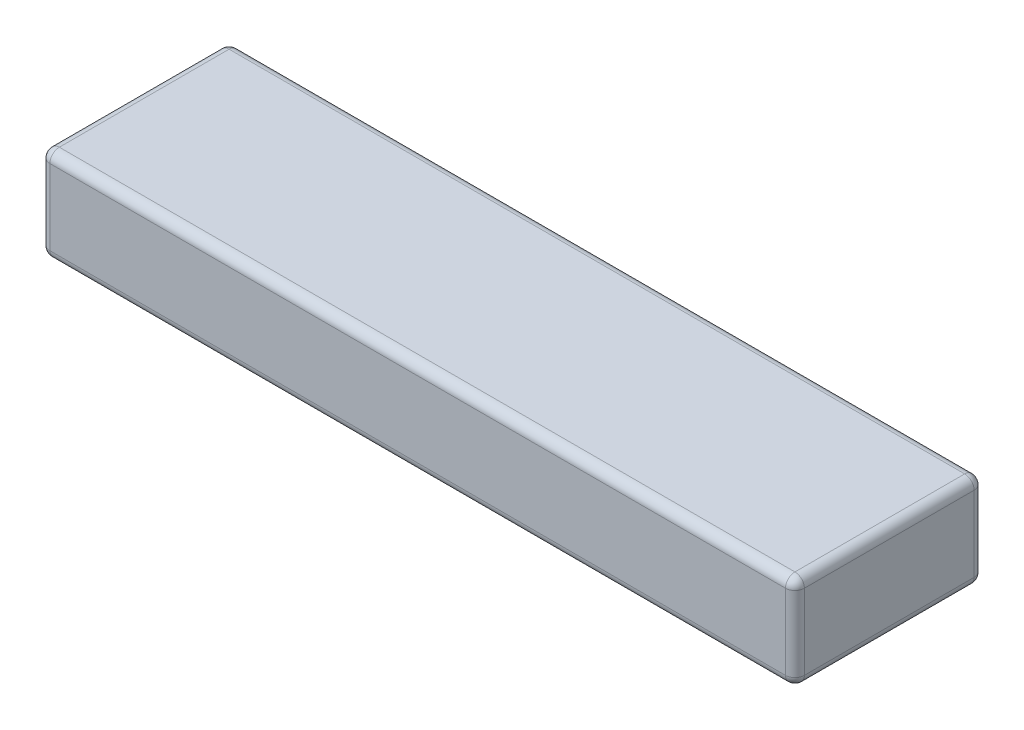
ISO-10303-21;
HEADER;
FILE_DESCRIPTION(('STEP AP214'),'2;1');
FILE_NAME('part.step','',(''),(''),'','','');
FILE_SCHEMA(('AUTOMOTIVE_DESIGN { 1 0 10303 214 1 1 1 1 }'));
ENDSEC;
DATA;
#1=APPLICATION_CONTEXT('core data for automotive mechanical design processes');
#2=APPLICATION_PROTOCOL_DEFINITION('international standard','automotive_design',2000,#1);
#3=PRODUCT_CONTEXT('',#1,'mechanical');
#4=PRODUCT('Part','Part','',(#3));
#5=PRODUCT_RELATED_PRODUCT_CATEGORY('part','',(#4));
#6=PRODUCT_DEFINITION_FORMATION('','',#4);
#7=PRODUCT_DEFINITION_CONTEXT('part definition',#1,'design');
#8=PRODUCT_DEFINITION('design','',#6,#7);
#9=PRODUCT_DEFINITION_SHAPE('','',#8);
#10=(LENGTH_UNIT() NAMED_UNIT(*) SI_UNIT(.MILLI.,.METRE.));
#11=(NAMED_UNIT(*) PLANE_ANGLE_UNIT() SI_UNIT($,.RADIAN.));
#12=(NAMED_UNIT(*) SI_UNIT($,.STERADIAN.) SOLID_ANGLE_UNIT());
#13=UNCERTAINTY_MEASURE_WITH_UNIT(LENGTH_MEASURE(1.E-05),#10,'distance_accuracy_value','');
#14=(GEOMETRIC_REPRESENTATION_CONTEXT(3) GLOBAL_UNCERTAINTY_ASSIGNED_CONTEXT((#13)) GLOBAL_UNIT_ASSIGNED_CONTEXT((#10,
#11,#12)) REPRESENTATION_CONTEXT('',''));
#15=CARTESIAN_POINT('',(0.,0.,0.));
#16=DIRECTION('',(0.,0.,1.));
#17=DIRECTION('',(1.,0.,0.));
#18=AXIS2_PLACEMENT_3D('',#15,#16,#17);
#19=CARTESIAN_POINT('',(20.,5.,5.));
#20=DIRECTION('',(-1.,0.,0.));
#21=DIRECTION('',(0.,0.,1.));
#22=AXIS2_PLACEMENT_3D('',#19,#20,#21);
#23=PLANE('',#22);
#24=DIRECTION('',(0.,-1.,0.));
#25=VECTOR('',#24,1.);
#26=CARTESIAN_POINT('',(20.,5.,-4.5));
#27=LINE('',#26,#25);
#28=CARTESIAN_POINT('',(20.,0.5,-4.5));
#29=VERTEX_POINT('',#28);
#30=CARTESIAN_POINT('',(20.,4.5,-4.5));
#31=VERTEX_POINT('',#30);
#32=EDGE_CURVE('E190',#29,#31,#27,.F.);
#33=ORIENTED_EDGE('',*,*,#32,.T.);
#34=DIRECTION('',(0.,0.,-1.));
#35=VECTOR('',#34,1.);
#36=CARTESIAN_POINT('',(20.,4.5,5.));
#37=LINE('',#36,#35);
#38=CARTESIAN_POINT('',(20.,4.5,4.5));
#39=VERTEX_POINT('',#38);
#40=EDGE_CURVE('E192',#31,#39,#37,.F.);
#41=ORIENTED_EDGE('',*,*,#40,.T.);
#42=DIRECTION('',(0.,-1.,0.));
#43=VECTOR('',#42,1.);
#44=CARTESIAN_POINT('',(20.,5.,4.5));
#45=LINE('',#44,#43);
#46=CARTESIAN_POINT('',(20.,0.5,4.5));
#47=VERTEX_POINT('',#46);
#48=EDGE_CURVE('E186',#39,#47,#45,.T.);
#49=ORIENTED_EDGE('',*,*,#48,.T.);
#50=DIRECTION('',(0.,0.,-1.));
#51=VECTOR('',#50,1.);
#52=CARTESIAN_POINT('',(20.,0.5,-5.));
#53=LINE('',#52,#51);
#54=EDGE_CURVE('E188',#47,#29,#53,.T.);
#55=ORIENTED_EDGE('',*,*,#54,.T.);
#56=EDGE_LOOP('',(#33,#41,#49,#55));
#57=FACE_BOUND('',#56,.T.);
#58=ADVANCED_FACE('F33',(#57),#23,.F.);
#59=CARTESIAN_POINT('',(-20.,5.,-5.));
#60=DIRECTION('',(0.,0.,1.));
#61=DIRECTION('',(1.,0.,0.));
#62=AXIS2_PLACEMENT_3D('',#59,#60,#61);
#63=PLANE('',#62);
#64=DIRECTION('',(-1.,0.,0.));
#65=VECTOR('',#64,1.);
#66=CARTESIAN_POINT('',(-20.,0.5,-5.));
#67=LINE('',#66,#65);
#68=CARTESIAN_POINT('',(19.5,0.5,-5.));
#69=VERTEX_POINT('',#68);
#70=CARTESIAN_POINT('',(-19.5,0.5,-5.));
#71=VERTEX_POINT('',#70);
#72=EDGE_CURVE('E172',#69,#71,#67,.T.);
#73=ORIENTED_EDGE('',*,*,#72,.T.);
#74=DIRECTION('',(0.,-1.,0.));
#75=VECTOR('',#74,1.);
#76=CARTESIAN_POINT('',(-19.5,5.,-5.));
#77=LINE('',#76,#75);
#78=CARTESIAN_POINT('',(-19.5,4.5,-5.));
#79=VERTEX_POINT('',#78);
#80=EDGE_CURVE('E174',#71,#79,#77,.F.);
#81=ORIENTED_EDGE('',*,*,#80,.T.);
#82=DIRECTION('',(-1.,0.,0.));
#83=VECTOR('',#82,1.);
#84=CARTESIAN_POINT('',(-20.,4.5,-5.));
#85=LINE('',#84,#83);
#86=CARTESIAN_POINT('',(19.5,4.5,-5.));
#87=VERTEX_POINT('',#86);
#88=EDGE_CURVE('E170',#79,#87,#85,.F.);
#89=ORIENTED_EDGE('',*,*,#88,.T.);
#90=DIRECTION('',(0.,-1.,0.));
#91=VECTOR('',#90,1.);
#92=CARTESIAN_POINT('',(19.5,5.,-5.));
#93=LINE('',#92,#91);
#94=EDGE_CURVE('E168',#87,#69,#93,.T.);
#95=ORIENTED_EDGE('',*,*,#94,.T.);
#96=EDGE_LOOP('',(#73,#81,#89,#95));
#97=FACE_BOUND('',#96,.T.);
#98=ADVANCED_FACE('F272',(#97),#63,.F.);
#99=CARTESIAN_POINT('',(-20.,5.,5.));
#100=DIRECTION('',(1.,0.,0.));
#101=DIRECTION('',(0.,0.,-1.));
#102=AXIS2_PLACEMENT_3D('',#99,#100,#101);
#103=PLANE('',#102);
#104=DIRECTION('',(0.,-1.,0.));
#105=VECTOR('',#104,1.);
#106=CARTESIAN_POINT('',(-20.,5.,-4.5));
#107=LINE('',#106,#105);
#108=CARTESIAN_POINT('',(-20.,4.5,-4.5));
#109=VERTEX_POINT('',#108);
#110=CARTESIAN_POINT('',(-20.,0.5,-4.5));
#111=VERTEX_POINT('',#110);
#112=EDGE_CURVE('E155',#109,#111,#107,.T.);
#113=ORIENTED_EDGE('',*,*,#112,.T.);
#114=DIRECTION('',(0.,0.,1.));
#115=VECTOR('',#114,1.);
#116=CARTESIAN_POINT('',(-20.,0.5,5.));
#117=LINE('',#116,#115);
#118=CARTESIAN_POINT('',(-20.,0.5,4.5));
#119=VERTEX_POINT('',#118);
#120=EDGE_CURVE('E127',#111,#119,#117,.T.);
#121=ORIENTED_EDGE('',*,*,#120,.T.);
#122=DIRECTION('',(0.,-1.,0.));
#123=VECTOR('',#122,1.);
#124=CARTESIAN_POINT('',(-20.,5.,4.5));
#125=LINE('',#124,#123);
#126=CARTESIAN_POINT('',(-20.,4.5,4.5));
#127=VERTEX_POINT('',#126);
#128=EDGE_CURVE('E145',#119,#127,#125,.F.);
#129=ORIENTED_EDGE('',*,*,#128,.T.);
#130=DIRECTION('',(0.,0.,1.));
#131=VECTOR('',#130,1.);
#132=CARTESIAN_POINT('',(-20.,4.5,5.));
#133=LINE('',#132,#131);
#134=EDGE_CURVE('E151',#127,#109,#133,.F.);
#135=ORIENTED_EDGE('',*,*,#134,.T.);
#136=EDGE_LOOP('',(#113,#121,#129,#135));
#137=FACE_BOUND('',#136,.T.);
#138=ADVANCED_FACE('F153',(#137),#103,.F.);
#139=CARTESIAN_POINT('',(-20.,5.,5.));
#140=DIRECTION('',(0.,0.,-1.));
#141=DIRECTION('',(-1.,0.,0.));
#142=AXIS2_PLACEMENT_3D('',#139,#140,#141);
#143=PLANE('',#142);
#144=DIRECTION('',(1.,0.,0.));
#145=VECTOR('',#144,1.);
#146=CARTESIAN_POINT('',(-20.,4.5,5.));
#147=LINE('',#146,#145);
#148=CARTESIAN_POINT('',(19.5,4.5,5.));
#149=VERTEX_POINT('',#148);
#150=CARTESIAN_POINT('',(-19.5,4.5,5.));
#151=VERTEX_POINT('',#150);
#152=EDGE_CURVE('E42',#149,#151,#147,.F.);
#153=ORIENTED_EDGE('',*,*,#152,.T.);
#154=DIRECTION('',(0.,-1.,0.));
#155=VECTOR('',#154,1.);
#156=CARTESIAN_POINT('',(-19.5,5.,5.));
#157=LINE('',#156,#155);
#158=CARTESIAN_POINT('',(-19.5,0.5,5.));
#159=VERTEX_POINT('',#158);
#160=EDGE_CURVE('E11',#151,#159,#157,.T.);
#161=ORIENTED_EDGE('',*,*,#160,.T.);
#162=DIRECTION('',(1.,0.,0.));
#163=VECTOR('',#162,1.);
#164=CARTESIAN_POINT('',(20.,0.5,5.));
#165=LINE('',#164,#163);
#166=CARTESIAN_POINT('',(19.5,0.5,5.));
#167=VERTEX_POINT('',#166);
#168=EDGE_CURVE('E195',#159,#167,#165,.T.);
#169=ORIENTED_EDGE('',*,*,#168,.T.);
#170=DIRECTION('',(0.,-1.,0.));
#171=VECTOR('',#170,1.);
#172=CARTESIAN_POINT('',(19.5,5.,5.));
#173=LINE('',#172,#171);
#174=EDGE_CURVE('E53',#167,#149,#173,.F.);
#175=ORIENTED_EDGE('',*,*,#174,.T.);
#176=EDGE_LOOP('',(#153,#161,#169,#175));
#177=FACE_BOUND('',#176,.T.);
#178=ADVANCED_FACE('F491',(#177),#143,.F.);
#179=CARTESIAN_POINT('',(0.,5.,0.));
#180=DIRECTION('',(0.,-1.,0.));
#181=DIRECTION('',(0.,0.,-1.));
#182=AXIS2_PLACEMENT_3D('',#179,#180,#181);
#183=PLANE('',#182);
#184=DIRECTION('',(-1.,0.,0.));
#185=VECTOR('',#184,1.);
#186=CARTESIAN_POINT('',(0.,5.,-4.5));
#187=LINE('',#186,#185);
#188=CARTESIAN_POINT('',(19.5,5.,-4.5));
#189=VERTEX_POINT('',#188);
#190=CARTESIAN_POINT('',(-19.5,5.,-4.5));
#191=VERTEX_POINT('',#190);
#192=EDGE_CURVE('E181',#189,#191,#187,.T.);
#193=ORIENTED_EDGE('',*,*,#192,.T.);
#194=DIRECTION('',(0.,0.,1.));
#195=VECTOR('',#194,1.);
#196=CARTESIAN_POINT('',(-19.5,5.,0.));
#197=LINE('',#196,#195);
#198=CARTESIAN_POINT('',(-19.5,5.,4.5));
#199=VERTEX_POINT('',#198);
#200=EDGE_CURVE('E183',#191,#199,#197,.T.);
#201=ORIENTED_EDGE('',*,*,#200,.T.);
#202=DIRECTION('',(1.,0.,0.));
#203=VECTOR('',#202,1.);
#204=CARTESIAN_POINT('',(0.,5.,4.5));
#205=LINE('',#204,#203);
#206=CARTESIAN_POINT('',(19.5,5.,4.5));
#207=VERTEX_POINT('',#206);
#208=EDGE_CURVE('E177',#199,#207,#205,.T.);
#209=ORIENTED_EDGE('',*,*,#208,.T.);
#210=DIRECTION('',(0.,0.,-1.));
#211=VECTOR('',#210,1.);
#212=CARTESIAN_POINT('',(19.5,5.,0.));
#213=LINE('',#212,#211);
#214=EDGE_CURVE('E179',#207,#189,#213,.T.);
#215=ORIENTED_EDGE('',*,*,#214,.T.);
#216=EDGE_LOOP('',(#193,#201,#209,#215));
#217=FACE_BOUND('',#216,.T.);
#218=ADVANCED_FACE('F281',(#217),#183,.F.);
#219=CARTESIAN_POINT('',(0.,0.,0.));
#220=DIRECTION('',(0.,-1.,0.));
#221=DIRECTION('',(0.,0.,-1.));
#222=AXIS2_PLACEMENT_3D('',#219,#220,#221);
#223=PLANE('',#222);
#224=DIRECTION('',(1.,0.,0.));
#225=VECTOR('',#224,1.);
#226=CARTESIAN_POINT('',(-20.,0.,4.5));
#227=LINE('',#226,#225);
#228=CARTESIAN_POINT('',(19.5,0.,4.5));
#229=VERTEX_POINT('',#228);
#230=CARTESIAN_POINT('',(-19.5,0.,4.5));
#231=VERTEX_POINT('',#230);
#232=EDGE_CURVE('E157',#229,#231,#227,.F.);
#233=ORIENTED_EDGE('',*,*,#232,.T.);
#234=DIRECTION('',(0.,0.,1.));
#235=VECTOR('',#234,1.);
#236=CARTESIAN_POINT('',(-19.5,0.,-5.));
#237=LINE('',#236,#235);
#238=CARTESIAN_POINT('',(-19.5,0.,-4.5));
#239=VERTEX_POINT('',#238);
#240=EDGE_CURVE('E129',#231,#239,#237,.F.);
#241=ORIENTED_EDGE('',*,*,#240,.T.);
#242=DIRECTION('',(-1.,0.,0.));
#243=VECTOR('',#242,1.);
#244=CARTESIAN_POINT('',(20.,0.,-4.5));
#245=LINE('',#244,#243);
#246=CARTESIAN_POINT('',(19.5,0.,-4.5));
#247=VERTEX_POINT('',#246);
#248=EDGE_CURVE('E165',#239,#247,#245,.F.);
#249=ORIENTED_EDGE('',*,*,#248,.T.);
#250=DIRECTION('',(0.,0.,-1.));
#251=VECTOR('',#250,1.);
#252=CARTESIAN_POINT('',(19.5,0.,5.));
#253=LINE('',#252,#251);
#254=EDGE_CURVE('E159',#247,#229,#253,.F.);
#255=ORIENTED_EDGE('',*,*,#254,.T.);
#256=EDGE_LOOP('',(#233,#241,#249,#255));
#257=FACE_BOUND('',#256,.T.);
#258=ADVANCED_FACE('F307',(#257),#223,.T.);
#259=CARTESIAN_POINT('',(19.5,4.5,0.));
#260=DIRECTION('',(0.,0.,-1.));
#261=DIRECTION('',(-1.,0.,0.));
#262=AXIS2_PLACEMENT_3D('',#259,#260,#261);
#263=CYLINDRICAL_SURFACE('',#262,0.5);
#264=CARTESIAN_POINT('',(19.5,4.5,-4.5));
#265=DIRECTION('',(0.,0.,-1.));
#266=DIRECTION('',(-1.,0.,0.));
#267=AXIS2_PLACEMENT_3D('',#264,#265,#266);
#268=CIRCLE('',#267,0.5);
#269=EDGE_CURVE('E37',#189,#31,#268,.T.);
#270=ORIENTED_EDGE('',*,*,#269,.F.);
#271=ORIENTED_EDGE('',*,*,#214,.F.);
#272=CARTESIAN_POINT('',(19.5,4.5,4.5));
#273=DIRECTION('',(0.,0.,1.));
#274=DIRECTION('',(1.,0.,0.));
#275=AXIS2_PLACEMENT_3D('',#272,#273,#274);
#276=CIRCLE('',#275,0.5);
#277=EDGE_CURVE('E248',#39,#207,#276,.T.);
#278=ORIENTED_EDGE('',*,*,#277,.F.);
#279=ORIENTED_EDGE('',*,*,#40,.F.);
#280=EDGE_LOOP('',(#270,#271,#278,#279));
#281=FACE_BOUND('',#280,.T.);
#282=ADVANCED_FACE('F35',(#281),#263,.T.);
#283=CARTESIAN_POINT('',(19.5,4.5,-4.5));
#284=DIRECTION('',(0.,0.,1.));
#285=DIRECTION('',(1.,0.,0.));
#286=AXIS2_PLACEMENT_3D('',#283,#284,#285);
#287=SPHERICAL_SURFACE('',#286,0.5);
#288=CARTESIAN_POINT('',(19.5,4.5,-4.5));
#289=DIRECTION('',(1.,0.,0.));
#290=DIRECTION('',(0.,1.,0.));
#291=AXIS2_PLACEMENT_3D('',#288,#289,#290);
#292=CIRCLE('',#291,0.5);
#293=EDGE_CURVE('E243',#189,#87,#292,.F.);
#294=ORIENTED_EDGE('',*,*,#293,.F.);
#295=ORIENTED_EDGE('',*,*,#269,.T.);
#296=CARTESIAN_POINT('',(19.5,4.5,-4.5));
#297=DIRECTION('',(0.,1.,0.));
#298=DIRECTION('',(0.,0.,1.));
#299=AXIS2_PLACEMENT_3D('',#296,#297,#298);
#300=CIRCLE('',#299,0.5);
#301=EDGE_CURVE('E246',#87,#31,#300,.F.);
#302=ORIENTED_EDGE('',*,*,#301,.F.);
#303=EDGE_LOOP('',(#294,#295,#302));
#304=FACE_BOUND('',#303,.T.);
#305=ADVANCED_FACE('F259',(#304),#287,.T.);
#306=CARTESIAN_POINT('',(19.5,4.5,4.5));
#307=DIRECTION('',(0.,0.,1.));
#308=DIRECTION('',(1.,0.,0.));
#309=AXIS2_PLACEMENT_3D('',#306,#307,#308);
#310=SPHERICAL_SURFACE('',#309,0.5);
#311=CARTESIAN_POINT('',(19.5,4.5,4.5));
#312=DIRECTION('',(0.,1.,0.));
#313=DIRECTION('',(0.,0.,1.));
#314=AXIS2_PLACEMENT_3D('',#311,#312,#313);
#315=CIRCLE('',#314,0.5);
#316=EDGE_CURVE('E238',#39,#149,#315,.F.);
#317=ORIENTED_EDGE('',*,*,#316,.F.);
#318=ORIENTED_EDGE('',*,*,#277,.T.);
#319=CARTESIAN_POINT('',(19.5,4.5,4.5));
#320=DIRECTION('',(1.,0.,0.));
#321=DIRECTION('',(0.,0.,-1.));
#322=AXIS2_PLACEMENT_3D('',#319,#320,#321);
#323=CIRCLE('',#322,0.5);
#324=EDGE_CURVE('E240',#149,#207,#323,.F.);
#325=ORIENTED_EDGE('',*,*,#324,.F.);
#326=EDGE_LOOP('',(#317,#318,#325));
#327=FACE_BOUND('',#326,.T.);
#328=ADVANCED_FACE('F457',(#327),#310,.T.);
#329=CARTESIAN_POINT('',(19.5,5.,-4.5));
#330=DIRECTION('',(0.,-1.,0.));
#331=DIRECTION('',(0.,0.,-1.));
#332=AXIS2_PLACEMENT_3D('',#329,#330,#331);
#333=CYLINDRICAL_SURFACE('',#332,0.5);
#334=ORIENTED_EDGE('',*,*,#301,.T.);
#335=ORIENTED_EDGE('',*,*,#32,.F.);
#336=CARTESIAN_POINT('',(19.5,0.5,-4.5));
#337=DIRECTION('',(0.,-1.,0.));
#338=DIRECTION('',(0.,0.,-1.));
#339=AXIS2_PLACEMENT_3D('',#336,#337,#338);
#340=CIRCLE('',#339,0.5);
#341=EDGE_CURVE('E232',#69,#29,#340,.T.);
#342=ORIENTED_EDGE('',*,*,#341,.F.);
#343=ORIENTED_EDGE('',*,*,#94,.F.);
#344=EDGE_LOOP('',(#334,#335,#342,#343));
#345=FACE_BOUND('',#344,.T.);
#346=ADVANCED_FACE('F267',(#345),#333,.T.);
#347=CARTESIAN_POINT('',(0.,4.5,-4.5));
#348=DIRECTION('',(-1.,0.,0.));
#349=DIRECTION('',(0.,0.,1.));
#350=AXIS2_PLACEMENT_3D('',#347,#348,#349);
#351=CYLINDRICAL_SURFACE('',#350,0.5);
#352=ORIENTED_EDGE('',*,*,#293,.T.);
#353=ORIENTED_EDGE('',*,*,#88,.F.);
#354=CARTESIAN_POINT('',(-19.5,4.5,-4.5));
#355=DIRECTION('',(-1.,0.,0.));
#356=DIRECTION('',(0.,0.,1.));
#357=AXIS2_PLACEMENT_3D('',#354,#355,#356);
#358=CIRCLE('',#357,0.5);
#359=EDGE_CURVE('E229',#191,#79,#358,.T.);
#360=ORIENTED_EDGE('',*,*,#359,.F.);
#361=ORIENTED_EDGE('',*,*,#192,.F.);
#362=EDGE_LOOP('',(#352,#353,#360,#361));
#363=FACE_BOUND('',#362,.T.);
#364=ADVANCED_FACE('F278',(#363),#351,.T.);
#365=CARTESIAN_POINT('',(-19.5,4.5,0.));
#366=DIRECTION('',(0.,0.,1.));
#367=DIRECTION('',(1.,0.,0.));
#368=AXIS2_PLACEMENT_3D('',#365,#366,#367);
#369=CYLINDRICAL_SURFACE('',#368,0.5);
#370=CARTESIAN_POINT('',(-19.5,4.5,4.5));
#371=DIRECTION('',(0.,0.,1.));
#372=DIRECTION('',(1.,0.,0.));
#373=AXIS2_PLACEMENT_3D('',#370,#371,#372);
#374=CIRCLE('',#373,0.5);
#375=EDGE_CURVE('E223',#199,#127,#374,.T.);
#376=ORIENTED_EDGE('',*,*,#375,.F.);
#377=ORIENTED_EDGE('',*,*,#200,.F.);
#378=CARTESIAN_POINT('',(-19.5,4.5,-4.5));
#379=DIRECTION('',(0.,0.,-1.));
#380=DIRECTION('',(0.,1.,0.));
#381=AXIS2_PLACEMENT_3D('',#378,#379,#380);
#382=CIRCLE('',#381,0.5);
#383=EDGE_CURVE('E226',#109,#191,#382,.T.);
#384=ORIENTED_EDGE('',*,*,#383,.F.);
#385=ORIENTED_EDGE('',*,*,#134,.F.);
#386=EDGE_LOOP('',(#376,#377,#384,#385));
#387=FACE_BOUND('',#386,.T.);
#388=ADVANCED_FACE('F285',(#387),#369,.T.);
#389=CARTESIAN_POINT('',(0.,4.5,4.5));
#390=DIRECTION('',(1.,0.,0.));
#391=DIRECTION('',(0.,0.,-1.));
#392=AXIS2_PLACEMENT_3D('',#389,#390,#391);
#393=CYLINDRICAL_SURFACE('',#392,0.5);
#394=ORIENTED_EDGE('',*,*,#324,.T.);
#395=ORIENTED_EDGE('',*,*,#208,.F.);
#396=CARTESIAN_POINT('',(-19.5,4.5,4.5));
#397=DIRECTION('',(-1.,0.,0.));
#398=DIRECTION('',(0.,0.,1.));
#399=AXIS2_PLACEMENT_3D('',#396,#397,#398);
#400=CIRCLE('',#399,0.5);
#401=EDGE_CURVE('E221',#151,#199,#400,.T.);
#402=ORIENTED_EDGE('',*,*,#401,.F.);
#403=ORIENTED_EDGE('',*,*,#152,.F.);
#404=EDGE_LOOP('',(#394,#395,#402,#403));
#405=FACE_BOUND('',#404,.T.);
#406=ADVANCED_FACE('F290',(#405),#393,.T.);
#407=CARTESIAN_POINT('',(19.5,5.,4.5));
#408=DIRECTION('',(0.,-1.,0.));
#409=DIRECTION('',(0.,0.,-1.));
#410=AXIS2_PLACEMENT_3D('',#407,#408,#409);
#411=CYLINDRICAL_SURFACE('',#410,0.5);
#412=ORIENTED_EDGE('',*,*,#316,.T.);
#413=ORIENTED_EDGE('',*,*,#174,.F.);
#414=CARTESIAN_POINT('',(19.5,0.5,4.5));
#415=DIRECTION('',(0.,-1.,0.));
#416=DIRECTION('',(0.,0.,-1.));
#417=AXIS2_PLACEMENT_3D('',#414,#415,#416);
#418=CIRCLE('',#417,0.5);
#419=EDGE_CURVE('E218',#47,#167,#418,.T.);
#420=ORIENTED_EDGE('',*,*,#419,.F.);
#421=ORIENTED_EDGE('',*,*,#48,.F.);
#422=EDGE_LOOP('',(#412,#413,#420,#421));
#423=FACE_BOUND('',#422,.T.);
#424=ADVANCED_FACE('F300',(#423),#411,.T.);
#425=CARTESIAN_POINT('',(19.5,0.5,5.));
#426=DIRECTION('',(0.,0.,1.));
#427=DIRECTION('',(1.,0.,0.));
#428=AXIS2_PLACEMENT_3D('',#425,#426,#427);
#429=CYLINDRICAL_SURFACE('',#428,0.5);
#430=CARTESIAN_POINT('',(19.5,0.5,-4.5));
#431=DIRECTION('',(0.,0.,-1.));
#432=DIRECTION('',(-1.,0.,0.));
#433=AXIS2_PLACEMENT_3D('',#430,#431,#432);
#434=CIRCLE('',#433,0.5);
#435=EDGE_CURVE('E235',#29,#247,#434,.T.);
#436=ORIENTED_EDGE('',*,*,#435,.F.);
#437=ORIENTED_EDGE('',*,*,#54,.F.);
#438=CARTESIAN_POINT('',(19.5,0.5,4.5));
#439=DIRECTION('',(0.,0.,1.));
#440=DIRECTION('',(1.,0.,0.));
#441=AXIS2_PLACEMENT_3D('',#438,#439,#440);
#442=CIRCLE('',#441,0.5);
#443=EDGE_CURVE('E215',#229,#47,#442,.T.);
#444=ORIENTED_EDGE('',*,*,#443,.F.);
#445=ORIENTED_EDGE('',*,*,#254,.F.);
#446=EDGE_LOOP('',(#436,#437,#444,#445));
#447=FACE_BOUND('',#446,.T.);
#448=ADVANCED_FACE('F296',(#447),#429,.T.);
#449=CARTESIAN_POINT('',(19.5,0.5,-4.5));
#450=DIRECTION('',(0.,0.,1.));
#451=DIRECTION('',(1.,0.,0.));
#452=AXIS2_PLACEMENT_3D('',#449,#450,#451);
#453=SPHERICAL_SURFACE('',#452,0.5);
#454=ORIENTED_EDGE('',*,*,#341,.T.);
#455=ORIENTED_EDGE('',*,*,#435,.T.);
#456=CARTESIAN_POINT('',(19.5,0.5,-4.5));
#457=DIRECTION('',(1.,0.,0.));
#458=DIRECTION('',(0.,0.,-1.));
#459=AXIS2_PLACEMENT_3D('',#456,#457,#458);
#460=CIRCLE('',#459,0.5);
#461=EDGE_CURVE('E212',#69,#247,#460,.F.);
#462=ORIENTED_EDGE('',*,*,#461,.F.);
#463=EDGE_LOOP('',(#454,#455,#462));
#464=FACE_BOUND('',#463,.T.);
#465=ADVANCED_FACE('F310',(#464),#453,.T.);
#466=CARTESIAN_POINT('',(-19.5,4.5,-4.5));
#467=DIRECTION('',(0.,0.,1.));
#468=DIRECTION('',(1.,0.,0.));
#469=AXIS2_PLACEMENT_3D('',#466,#467,#468);
#470=SPHERICAL_SURFACE('',#469,0.5);
#471=ORIENTED_EDGE('',*,*,#383,.T.);
#472=ORIENTED_EDGE('',*,*,#359,.T.);
#473=CARTESIAN_POINT('',(-19.5,4.5,-4.5));
#474=DIRECTION('',(0.,1.,0.));
#475=DIRECTION('',(0.,0.,1.));
#476=AXIS2_PLACEMENT_3D('',#473,#474,#475);
#477=CIRCLE('',#476,0.5);
#478=EDGE_CURVE('E210',#109,#79,#477,.F.);
#479=ORIENTED_EDGE('',*,*,#478,.F.);
#480=EDGE_LOOP('',(#471,#472,#479));
#481=FACE_BOUND('',#480,.T.);
#482=ADVANCED_FACE('F320',(#481),#470,.T.);
#483=CARTESIAN_POINT('',(-19.5,4.5,4.5));
#484=DIRECTION('',(0.,0.,1.));
#485=DIRECTION('',(1.,0.,0.));
#486=AXIS2_PLACEMENT_3D('',#483,#484,#485);
#487=SPHERICAL_SURFACE('',#486,0.5);
#488=ORIENTED_EDGE('',*,*,#401,.T.);
#489=ORIENTED_EDGE('',*,*,#375,.T.);
#490=CARTESIAN_POINT('',(-19.5,4.5,4.5));
#491=DIRECTION('',(0.,1.,0.));
#492=DIRECTION('',(0.,0.,1.));
#493=AXIS2_PLACEMENT_3D('',#490,#491,#492);
#494=CIRCLE('',#493,0.5);
#495=EDGE_CURVE('E148',#151,#127,#494,.F.);
#496=ORIENTED_EDGE('',*,*,#495,.F.);
#497=EDGE_LOOP('',(#488,#489,#496));
#498=FACE_BOUND('',#497,.T.);
#499=ADVANCED_FACE('F322',(#498),#487,.T.);
#500=CARTESIAN_POINT('',(19.5,0.5,4.5));
#501=DIRECTION('',(0.,0.,1.));
#502=DIRECTION('',(1.,0.,0.));
#503=AXIS2_PLACEMENT_3D('',#500,#501,#502);
#504=SPHERICAL_SURFACE('',#503,0.5);
#505=ORIENTED_EDGE('',*,*,#443,.T.);
#506=ORIENTED_EDGE('',*,*,#419,.T.);
#507=CARTESIAN_POINT('',(19.5,0.5,4.5));
#508=DIRECTION('',(1.,0.,0.));
#509=DIRECTION('',(0.,0.,-1.));
#510=AXIS2_PLACEMENT_3D('',#507,#508,#509);
#511=CIRCLE('',#510,0.5);
#512=EDGE_CURVE('E206',#229,#167,#511,.F.);
#513=ORIENTED_EDGE('',*,*,#512,.F.);
#514=EDGE_LOOP('',(#505,#506,#513));
#515=FACE_BOUND('',#514,.T.);
#516=ADVANCED_FACE('F302',(#515),#504,.T.);
#517=CARTESIAN_POINT('',(-20.,0.5,-4.5));
#518=DIRECTION('',(1.,0.,0.));
#519=DIRECTION('',(0.,0.,-1.));
#520=AXIS2_PLACEMENT_3D('',#517,#518,#519);
#521=CYLINDRICAL_SURFACE('',#520,0.5);
#522=ORIENTED_EDGE('',*,*,#461,.T.);
#523=ORIENTED_EDGE('',*,*,#248,.F.);
#524=CARTESIAN_POINT('',(-19.5,0.5,-4.5));
#525=DIRECTION('',(-1.,0.,0.));
#526=DIRECTION('',(0.,0.,1.));
#527=AXIS2_PLACEMENT_3D('',#524,#525,#526);
#528=CIRCLE('',#527,0.5);
#529=EDGE_CURVE('E203',#71,#239,#528,.T.);
#530=ORIENTED_EDGE('',*,*,#529,.F.);
#531=ORIENTED_EDGE('',*,*,#72,.F.);
#532=EDGE_LOOP('',(#522,#523,#530,#531));
#533=FACE_BOUND('',#532,.T.);
#534=ADVANCED_FACE('F312',(#533),#521,.T.);
#535=CARTESIAN_POINT('',(-19.5,5.,-4.5));
#536=DIRECTION('',(0.,-1.,0.));
#537=DIRECTION('',(0.,0.,-1.));
#538=AXIS2_PLACEMENT_3D('',#535,#536,#537);
#539=CYLINDRICAL_SURFACE('',#538,0.5);
#540=ORIENTED_EDGE('',*,*,#478,.T.);
#541=ORIENTED_EDGE('',*,*,#80,.F.);
#542=CARTESIAN_POINT('',(-19.5,0.5,-4.5));
#543=DIRECTION('',(0.,-1.,0.));
#544=DIRECTION('',(0.,0.,-1.));
#545=AXIS2_PLACEMENT_3D('',#542,#543,#544);
#546=CIRCLE('',#545,0.5);
#547=EDGE_CURVE('E142',#111,#71,#546,.T.);
#548=ORIENTED_EDGE('',*,*,#547,.F.);
#549=ORIENTED_EDGE('',*,*,#112,.F.);
#550=EDGE_LOOP('',(#540,#541,#548,#549));
#551=FACE_BOUND('',#550,.T.);
#552=ADVANCED_FACE('F318',(#551),#539,.T.);
#553=CARTESIAN_POINT('',(-19.5,5.,4.5));
#554=DIRECTION('',(0.,-1.,0.));
#555=DIRECTION('',(0.,0.,-1.));
#556=AXIS2_PLACEMENT_3D('',#553,#554,#555);
#557=CYLINDRICAL_SURFACE('',#556,0.5);
#558=ORIENTED_EDGE('',*,*,#495,.T.);
#559=ORIENTED_EDGE('',*,*,#128,.F.);
#560=CARTESIAN_POINT('',(-19.5,0.5,4.5));
#561=DIRECTION('',(0.,-1.,0.));
#562=DIRECTION('',(0.,0.,-1.));
#563=AXIS2_PLACEMENT_3D('',#560,#561,#562);
#564=CIRCLE('',#563,0.5);
#565=EDGE_CURVE('E134',#159,#119,#564,.T.);
#566=ORIENTED_EDGE('',*,*,#565,.F.);
#567=ORIENTED_EDGE('',*,*,#160,.F.);
#568=EDGE_LOOP('',(#558,#559,#566,#567));
#569=FACE_BOUND('',#568,.T.);
#570=ADVANCED_FACE('F146',(#569),#557,.T.);
#571=CARTESIAN_POINT('',(-20.,0.5,4.5));
#572=DIRECTION('',(-1.,0.,0.));
#573=DIRECTION('',(0.,0.,1.));
#574=AXIS2_PLACEMENT_3D('',#571,#572,#573);
#575=CYLINDRICAL_SURFACE('',#574,0.5);
#576=ORIENTED_EDGE('',*,*,#512,.T.);
#577=ORIENTED_EDGE('',*,*,#168,.F.);
#578=CARTESIAN_POINT('',(-19.5,0.5,4.5));
#579=DIRECTION('',(-1.,0.,0.));
#580=DIRECTION('',(0.,0.,1.));
#581=AXIS2_PLACEMENT_3D('',#578,#579,#580);
#582=CIRCLE('',#581,0.5);
#583=EDGE_CURVE('E138',#231,#159,#582,.T.);
#584=ORIENTED_EDGE('',*,*,#583,.F.);
#585=ORIENTED_EDGE('',*,*,#232,.F.);
#586=EDGE_LOOP('',(#576,#577,#584,#585));
#587=FACE_BOUND('',#586,.T.);
#588=ADVANCED_FACE('F305',(#587),#575,.T.);
#589=CARTESIAN_POINT('',(-19.5,0.5,-4.5));
#590=DIRECTION('',(0.,0.,1.));
#591=DIRECTION('',(1.,0.,0.));
#592=AXIS2_PLACEMENT_3D('',#589,#590,#591);
#593=SPHERICAL_SURFACE('',#592,0.5);
#594=ORIENTED_EDGE('',*,*,#547,.T.);
#595=ORIENTED_EDGE('',*,*,#529,.T.);
#596=CARTESIAN_POINT('',(-19.5,0.5,-4.5));
#597=DIRECTION('',(0.,0.,-1.));
#598=DIRECTION('',(-1.,0.,0.));
#599=AXIS2_PLACEMENT_3D('',#596,#597,#598);
#600=CIRCLE('',#599,0.5);
#601=EDGE_CURVE('E131',#111,#239,#600,.F.);
#602=ORIENTED_EDGE('',*,*,#601,.F.);
#603=EDGE_LOOP('',(#594,#595,#602));
#604=FACE_BOUND('',#603,.T.);
#605=ADVANCED_FACE('F316',(#604),#593,.T.);
#606=CARTESIAN_POINT('',(-19.5,0.5,4.5));
#607=DIRECTION('',(0.,0.,1.));
#608=DIRECTION('',(1.,0.,0.));
#609=AXIS2_PLACEMENT_3D('',#606,#607,#608);
#610=SPHERICAL_SURFACE('',#609,0.5);
#611=ORIENTED_EDGE('',*,*,#583,.T.);
#612=ORIENTED_EDGE('',*,*,#565,.T.);
#613=CARTESIAN_POINT('',(-19.5,0.5,4.5));
#614=DIRECTION('',(0.,0.,1.));
#615=DIRECTION('',(1.,0.,0.));
#616=AXIS2_PLACEMENT_3D('',#613,#614,#615);
#617=CIRCLE('',#616,0.5);
#618=EDGE_CURVE('E123',#231,#119,#617,.F.);
#619=ORIENTED_EDGE('',*,*,#618,.F.);
#620=EDGE_LOOP('',(#611,#612,#619));
#621=FACE_BOUND('',#620,.T.);
#622=ADVANCED_FACE('F136',(#621),#610,.T.);
#623=CARTESIAN_POINT('',(-19.5,0.5,5.));
#624=DIRECTION('',(0.,0.,-1.));
#625=DIRECTION('',(-1.,0.,0.));
#626=AXIS2_PLACEMENT_3D('',#623,#624,#625);
#627=CYLINDRICAL_SURFACE('',#626,0.5);
#628=ORIENTED_EDGE('',*,*,#601,.T.);
#629=ORIENTED_EDGE('',*,*,#240,.F.);
#630=ORIENTED_EDGE('',*,*,#618,.T.);
#631=ORIENTED_EDGE('',*,*,#120,.F.);
#632=EDGE_LOOP('',(#628,#629,#630,#631));
#633=FACE_BOUND('',#632,.T.);
#634=ADVANCED_FACE('F125',(#633),#627,.T.);
#635=CLOSED_SHELL('',(#58,#98,#138,#178,#218,#258,#282,#305,#328,#346,#364,#388,#406,#424,#448,
#465,#482,#499,#516,#534,#552,#570,#588,#605,#622,#634));
#636=MANIFOLD_SOLID_BREP('B2',#635);
#637=ADVANCED_BREP_SHAPE_REPRESENTATION('',(#18,#636),#14);
#638=SHAPE_DEFINITION_REPRESENTATION(#9,#637);
ENDSEC;
END-ISO-10303-21;
